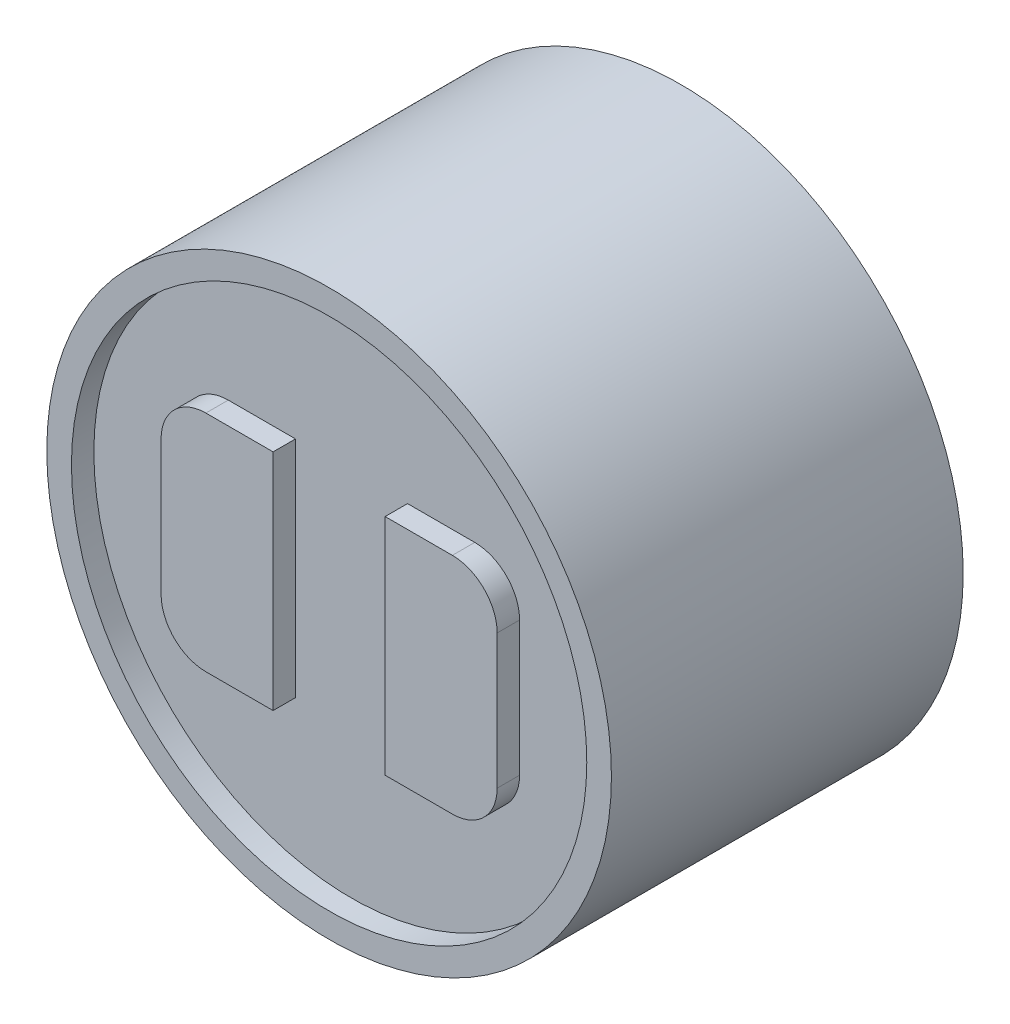
ISO-10303-21;
HEADER;
FILE_DESCRIPTION(('STEP AP214'),'2;1');
FILE_NAME('part.step','',(''),(''),'','','');
FILE_SCHEMA(('AUTOMOTIVE_DESIGN { 1 0 10303 214 1 1 1 1 }'));
ENDSEC;
DATA;
#1=APPLICATION_CONTEXT('core data for automotive mechanical design processes');
#2=APPLICATION_PROTOCOL_DEFINITION('international standard','automotive_design',2000,#1);
#3=PRODUCT_CONTEXT('',#1,'mechanical');
#4=PRODUCT('Part','Part','',(#3));
#5=PRODUCT_RELATED_PRODUCT_CATEGORY('part','',(#4));
#6=PRODUCT_DEFINITION_FORMATION('','',#4);
#7=PRODUCT_DEFINITION_CONTEXT('part definition',#1,'design');
#8=PRODUCT_DEFINITION('design','',#6,#7);
#9=PRODUCT_DEFINITION_SHAPE('','',#8);
#10=(LENGTH_UNIT() NAMED_UNIT(*) SI_UNIT(.MILLI.,.METRE.));
#11=(NAMED_UNIT(*) PLANE_ANGLE_UNIT() SI_UNIT($,.RADIAN.));
#12=(NAMED_UNIT(*) SI_UNIT($,.STERADIAN.) SOLID_ANGLE_UNIT());
#13=UNCERTAINTY_MEASURE_WITH_UNIT(LENGTH_MEASURE(1.E-05),#10,'distance_accuracy_value','');
#14=(GEOMETRIC_REPRESENTATION_CONTEXT(3) GLOBAL_UNCERTAINTY_ASSIGNED_CONTEXT((#13)) GLOBAL_UNIT_ASSIGNED_CONTEXT((#10,
#11,#12)) REPRESENTATION_CONTEXT('',''));
#15=CARTESIAN_POINT('',(0.,0.,0.));
#16=DIRECTION('',(0.,0.,1.));
#17=DIRECTION('',(1.,0.,0.));
#18=AXIS2_PLACEMENT_3D('',#15,#16,#17);
#19=CARTESIAN_POINT('',(-3.2333237010954,-8.71020362159421,28.1888965279297));
#20=DIRECTION('',(0.,0.,-1.));
#21=DIRECTION('',(-1.,0.,0.));
#22=AXIS2_PLACEMENT_3D('',#19,#20,#21);
#23=PLANE('',#22);
#24=CARTESIAN_POINT('',(-3.23332370109542,-7.18620362159421,28.1888965279297));
#25=DIRECTION('',(0.,0.,-1.));
#26=DIRECTION('',(-1.,0.,0.));
#27=AXIS2_PLACEMENT_3D('',#24,#25,#26);
#28=CIRCLE('',#27,0.508);
#29=CARTESIAN_POINT('',(-3.74132370109542,-7.18620362159421,28.1888965279297));
#30=VERTEX_POINT('',#29);
#31=CARTESIAN_POINT('',(-3.23332370109542,-6.67820362159421,28.1888965279297));
#32=VERTEX_POINT('',#31);
#33=EDGE_CURVE('E116',#30,#32,#28,.T.);
#34=ORIENTED_EDGE('',*,*,#33,.F.);
#35=DIRECTION('',(0.,1.,0.));
#36=VECTOR('',#35,1.);
#37=CARTESIAN_POINT('',(-3.74132370109541,-8.71020362159421,28.1888965279297));
#38=LINE('',#37,#36);
#39=CARTESIAN_POINT('',(-3.74132370109541,-8.71020362159421,28.1888965279297));
#40=VERTEX_POINT('',#39);
#41=EDGE_CURVE('E103',#40,#30,#38,.T.);
#42=ORIENTED_EDGE('',*,*,#41,.F.);
#43=CARTESIAN_POINT('',(-3.2333237010954,-8.71020362159421,28.1888965279297));
#44=DIRECTION('',(0.,0.,-1.));
#45=DIRECTION('',(-1.,0.,0.));
#46=AXIS2_PLACEMENT_3D('',#43,#44,#45);
#47=CIRCLE('',#46,0.508);
#48=CARTESIAN_POINT('',(-3.2333237010954,-9.21820362159421,28.1888965279297));
#49=VERTEX_POINT('',#48);
#50=EDGE_CURVE('E20',#49,#40,#47,.T.);
#51=ORIENTED_EDGE('',*,*,#50,.F.);
#52=DIRECTION('',(-1.,0.,0.));
#53=VECTOR('',#52,1.);
#54=CARTESIAN_POINT('',(-3.2333237010954,-9.21820362159421,28.1888965279297));
#55=LINE('',#54,#53);
#56=CARTESIAN_POINT('',(-2.4713237010954,-9.2182036215942,28.1888965279297));
#57=VERTEX_POINT('',#56);
#58=EDGE_CURVE('E89',#57,#49,#55,.T.);
#59=ORIENTED_EDGE('',*,*,#58,.F.);
#60=DIRECTION('',(0.,1.,0.));
#61=VECTOR('',#60,1.);
#62=CARTESIAN_POINT('',(-2.4713237010954,-9.2182036215942,28.1888965279297));
#63=LINE('',#62,#61);
#64=CARTESIAN_POINT('',(-2.47132370109542,-6.6782036215942,28.1888965279297));
#65=VERTEX_POINT('',#64);
#66=EDGE_CURVE('E198',#57,#65,#63,.T.);
#67=ORIENTED_EDGE('',*,*,#66,.T.);
#68=DIRECTION('',(-1.,0.,0.));
#69=VECTOR('',#68,1.);
#70=CARTESIAN_POINT('',(-3.23332370109542,-6.67820362159421,28.1888965279297));
#71=LINE('',#70,#69);
#72=EDGE_CURVE('E178',#65,#32,#71,.T.);
#73=ORIENTED_EDGE('',*,*,#72,.T.);
#74=EDGE_LOOP('',(#34,#42,#51,#59,#67,#73));
#75=FACE_BOUND('',#74,.T.);
#76=ADVANCED_FACE('F17',(#75),#23,.F.);
#77=CARTESIAN_POINT('',(-0.439323701095408,-8.71020362159419,28.1888965279297));
#78=DIRECTION('',(0.,0.,-1.));
#79=DIRECTION('',(-1.,0.,0.));
#80=AXIS2_PLACEMENT_3D('',#77,#78,#79);
#81=PLANE('',#80);
#82=CARTESIAN_POINT('',(-0.439323701095408,-8.71020362159419,28.1888965279297));
#83=DIRECTION('',(0.,0.,-1.));
#84=DIRECTION('',(-1.,0.,0.));
#85=AXIS2_PLACEMENT_3D('',#82,#83,#84);
#86=CIRCLE('',#85,0.508);
#87=CARTESIAN_POINT('',(0.0686762989045922,-8.71020362159418,28.1888965279297));
#88=VERTEX_POINT('',#87);
#89=CARTESIAN_POINT('',(-0.439323701095406,-9.21820362159419,28.1888965279297));
#90=VERTEX_POINT('',#89);
#91=EDGE_CURVE('E112',#88,#90,#86,.T.);
#92=ORIENTED_EDGE('',*,*,#91,.F.);
#93=DIRECTION('',(0.,1.,0.));
#94=VECTOR('',#93,1.);
#95=CARTESIAN_POINT('',(0.0686762989045922,-8.71020362159418,28.1888965279297));
#96=LINE('',#95,#94);
#97=CARTESIAN_POINT('',(0.0686762989045801,-7.18620362159418,28.1888965279297));
#98=VERTEX_POINT('',#97);
#99=EDGE_CURVE('E179',#98,#88,#96,.F.);
#100=ORIENTED_EDGE('',*,*,#99,.F.);
#101=CARTESIAN_POINT('',(-0.439323701095418,-7.18620362159419,28.1888965279297));
#102=DIRECTION('',(0.,0.,-1.));
#103=DIRECTION('',(-1.,0.,0.));
#104=AXIS2_PLACEMENT_3D('',#101,#102,#103);
#105=CIRCLE('',#104,0.508);
#106=CARTESIAN_POINT('',(-0.439323701095425,-6.67820362159419,28.1888965279297));
#107=VERTEX_POINT('',#106);
#108=EDGE_CURVE('E124',#107,#98,#105,.T.);
#109=ORIENTED_EDGE('',*,*,#108,.F.);
#110=DIRECTION('',(-1.,0.,0.));
#111=VECTOR('',#110,1.);
#112=CARTESIAN_POINT('',(-0.439323701095422,-6.67820362159419,28.1888965279297));
#113=LINE('',#112,#111);
#114=CARTESIAN_POINT('',(-1.20132370109542,-6.67820362159419,28.1888965279297));
#115=VERTEX_POINT('',#114);
#116=EDGE_CURVE('E119',#115,#107,#113,.F.);
#117=ORIENTED_EDGE('',*,*,#116,.F.);
#118=DIRECTION('',(0.,-1.,0.));
#119=VECTOR('',#118,1.);
#120=CARTESIAN_POINT('',(-1.2013237010954,-9.21820362159419,28.1888965279297));
#121=LINE('',#120,#119);
#122=CARTESIAN_POINT('',(-1.2013237010954,-9.21820362159419,28.1888965279297));
#123=VERTEX_POINT('',#122);
#124=EDGE_CURVE('E216',#115,#123,#121,.T.);
#125=ORIENTED_EDGE('',*,*,#124,.T.);
#126=DIRECTION('',(1.,0.,0.));
#127=VECTOR('',#126,1.);
#128=CARTESIAN_POINT('',(-1.2013237010954,-9.21820362159419,28.1888965279297));
#129=LINE('',#128,#127);
#130=EDGE_CURVE('E176',#123,#90,#129,.T.);
#131=ORIENTED_EDGE('',*,*,#130,.T.);
#132=EDGE_LOOP('',(#92,#100,#109,#117,#125,#131));
#133=FACE_BOUND('',#132,.T.);
#134=ADVANCED_FACE('F323',(#133),#81,.F.);
#135=CARTESIAN_POINT('',(-3.23332370109542,-7.18620362159421,28.1888965279297));
#136=DIRECTION('',(0.,0.,-1.));
#137=DIRECTION('',(-1.,0.,0.));
#138=AXIS2_PLACEMENT_3D('',#135,#136,#137);
#139=CYLINDRICAL_SURFACE('',#138,0.508);
#140=ORIENTED_EDGE('',*,*,#33,.T.);
#141=DIRECTION('',(0.,0.,-1.));
#142=VECTOR('',#141,1.);
#143=CARTESIAN_POINT('',(-3.23332370109542,-6.67820362159421,28.1888965279297));
#144=LINE('',#143,#142);
#145=CARTESIAN_POINT('',(-3.23332370109542,-6.67820362159421,27.9348965279297));
#146=VERTEX_POINT('',#145);
#147=EDGE_CURVE('E203',#32,#146,#144,.T.);
#148=ORIENTED_EDGE('',*,*,#147,.T.);
#149=CARTESIAN_POINT('',(-3.23332370109542,-7.18620362159421,27.9348965279297));
#150=DIRECTION('',(0.,0.,-1.));
#151=DIRECTION('',(-1.,0.,0.));
#152=AXIS2_PLACEMENT_3D('',#149,#150,#151);
#153=CIRCLE('',#152,0.508);
#154=CARTESIAN_POINT('',(-3.74132370109542,-7.18620362159421,27.9348965279297));
#155=VERTEX_POINT('',#154);
#156=EDGE_CURVE('E168',#155,#146,#153,.T.);
#157=ORIENTED_EDGE('',*,*,#156,.F.);
#158=DIRECTION('',(0.,0.,-1.));
#159=VECTOR('',#158,1.);
#160=CARTESIAN_POINT('',(-3.74132370109542,-7.18620362159421,28.1888965279297));
#161=LINE('',#160,#159);
#162=EDGE_CURVE('E113',#155,#30,#161,.F.);
#163=ORIENTED_EDGE('',*,*,#162,.T.);
#164=EDGE_LOOP('',(#140,#148,#157,#163));
#165=FACE_BOUND('',#164,.T.);
#166=ADVANCED_FACE('F494',(#165),#139,.T.);
#167=CARTESIAN_POINT('',(-3.23332370109542,-6.67820362159421,28.1888965279297));
#168=DIRECTION('',(0.,-1.,0.));
#169=DIRECTION('',(-1.,0.,0.));
#170=AXIS2_PLACEMENT_3D('',#167,#168,#169);
#171=PLANE('',#170);
#172=ORIENTED_EDGE('',*,*,#147,.F.);
#173=ORIENTED_EDGE('',*,*,#72,.F.);
#174=DIRECTION('',(0.,0.,-1.));
#175=VECTOR('',#174,1.);
#176=CARTESIAN_POINT('',(-2.47132370109542,-6.6782036215942,28.1888965279297));
#177=LINE('',#176,#175);
#178=CARTESIAN_POINT('',(-2.47132370109542,-6.6782036215942,27.9348965279297));
#179=VERTEX_POINT('',#178);
#180=EDGE_CURVE('E202',#65,#179,#177,.T.);
#181=ORIENTED_EDGE('',*,*,#180,.T.);
#182=DIRECTION('',(1.,0.,0.));
#183=VECTOR('',#182,1.);
#184=CARTESIAN_POINT('',(-1.83632370109542,-6.6782036215942,27.9348965279297));
#185=LINE('',#184,#183);
#186=EDGE_CURVE('E172',#146,#179,#185,.T.);
#187=ORIENTED_EDGE('',*,*,#186,.F.);
#188=EDGE_LOOP('',(#172,#173,#181,#187));
#189=FACE_BOUND('',#188,.T.);
#190=ADVANCED_FACE('F254',(#189),#171,.F.);
#191=CARTESIAN_POINT('',(-2.4713237010954,-9.2182036215942,28.1888965279297));
#192=DIRECTION('',(-1.,0.,0.));
#193=DIRECTION('',(0.,1.,0.));
#194=AXIS2_PLACEMENT_3D('',#191,#192,#193);
#195=PLANE('',#194);
#196=ORIENTED_EDGE('',*,*,#180,.F.);
#197=ORIENTED_EDGE('',*,*,#66,.F.);
#198=DIRECTION('',(0.,0.,-1.));
#199=VECTOR('',#198,1.);
#200=CARTESIAN_POINT('',(-2.4713237010954,-9.2182036215942,28.1888965279297));
#201=LINE('',#200,#199);
#202=CARTESIAN_POINT('',(-2.4713237010954,-9.2182036215942,27.9348965279297));
#203=VERTEX_POINT('',#202);
#204=EDGE_CURVE('E239',#57,#203,#201,.T.);
#205=ORIENTED_EDGE('',*,*,#204,.T.);
#206=DIRECTION('',(0.,1.,0.));
#207=VECTOR('',#206,1.);
#208=CARTESIAN_POINT('',(-2.47132370109541,-7.9482036215942,27.9348965279297));
#209=LINE('',#208,#207);
#210=EDGE_CURVE('E245',#179,#203,#209,.F.);
#211=ORIENTED_EDGE('',*,*,#210,.F.);
#212=EDGE_LOOP('',(#196,#197,#205,#211));
#213=FACE_BOUND('',#212,.T.);
#214=ADVANCED_FACE('F259',(#213),#195,.F.);
#215=CARTESIAN_POINT('',(-3.2333237010954,-9.21820362159421,28.1888965279297));
#216=DIRECTION('',(0.,1.,0.));
#217=DIRECTION('',(1.,0.,0.));
#218=AXIS2_PLACEMENT_3D('',#215,#216,#217);
#219=PLANE('',#218);
#220=ORIENTED_EDGE('',*,*,#204,.F.);
#221=ORIENTED_EDGE('',*,*,#58,.T.);
#222=DIRECTION('',(0.,0.,-1.));
#223=VECTOR('',#222,1.);
#224=CARTESIAN_POINT('',(-3.2333237010954,-9.21820362159421,28.1888965279297));
#225=LINE('',#224,#223);
#226=CARTESIAN_POINT('',(-3.2333237010954,-9.21820362159421,27.9348965279297));
#227=VERTEX_POINT('',#226);
#228=EDGE_CURVE('E99',#227,#49,#225,.F.);
#229=ORIENTED_EDGE('',*,*,#228,.F.);
#230=DIRECTION('',(1.,0.,0.));
#231=VECTOR('',#230,1.);
#232=CARTESIAN_POINT('',(-1.8363237010954,-9.2182036215942,27.9348965279297));
#233=LINE('',#232,#231);
#234=EDGE_CURVE('E167',#203,#227,#233,.F.);
#235=ORIENTED_EDGE('',*,*,#234,.F.);
#236=EDGE_LOOP('',(#220,#221,#229,#235));
#237=FACE_BOUND('',#236,.T.);
#238=ADVANCED_FACE('F317',(#237),#219,.F.);
#239=CARTESIAN_POINT('',(-3.2333237010954,-8.71020362159421,28.1888965279297));
#240=DIRECTION('',(0.,0.,-1.));
#241=DIRECTION('',(-1.,0.,0.));
#242=AXIS2_PLACEMENT_3D('',#239,#240,#241);
#243=CYLINDRICAL_SURFACE('',#242,0.508);
#244=ORIENTED_EDGE('',*,*,#50,.T.);
#245=DIRECTION('',(0.,0.,-1.));
#246=VECTOR('',#245,1.);
#247=CARTESIAN_POINT('',(-3.74132370109541,-8.71020362159421,28.1888965279297));
#248=LINE('',#247,#246);
#249=CARTESIAN_POINT('',(-3.74132370109541,-8.71020362159421,27.9348965279297));
#250=VERTEX_POINT('',#249);
#251=EDGE_CURVE('E97',#40,#250,#248,.T.);
#252=ORIENTED_EDGE('',*,*,#251,.T.);
#253=CARTESIAN_POINT('',(-3.2333237010954,-8.71020362159421,27.9348965279297));
#254=DIRECTION('',(0.,0.,-1.));
#255=DIRECTION('',(-1.,0.,0.));
#256=AXIS2_PLACEMENT_3D('',#253,#254,#255);
#257=CIRCLE('',#256,0.508);
#258=EDGE_CURVE('E164',#227,#250,#257,.T.);
#259=ORIENTED_EDGE('',*,*,#258,.F.);
#260=ORIENTED_EDGE('',*,*,#228,.T.);
#261=EDGE_LOOP('',(#244,#252,#259,#260));
#262=FACE_BOUND('',#261,.T.);
#263=ADVANCED_FACE('F95',(#262),#243,.T.);
#264=CARTESIAN_POINT('',(-3.74132370109541,-8.71020362159421,28.1888965279297));
#265=DIRECTION('',(1.,0.,0.));
#266=DIRECTION('',(0.,-1.,0.));
#267=AXIS2_PLACEMENT_3D('',#264,#265,#266);
#268=PLANE('',#267);
#269=ORIENTED_EDGE('',*,*,#251,.F.);
#270=ORIENTED_EDGE('',*,*,#41,.T.);
#271=ORIENTED_EDGE('',*,*,#162,.F.);
#272=DIRECTION('',(0.,1.,0.));
#273=VECTOR('',#272,1.);
#274=CARTESIAN_POINT('',(-3.74132370109542,-7.94820362159421,27.9348965279297));
#275=LINE('',#274,#273);
#276=EDGE_CURVE('E109',#250,#155,#275,.T.);
#277=ORIENTED_EDGE('',*,*,#276,.F.);
#278=EDGE_LOOP('',(#269,#270,#271,#277));
#279=FACE_BOUND('',#278,.T.);
#280=ADVANCED_FACE('F105',(#279),#268,.F.);
#281=CARTESIAN_POINT('',(-0.439323701095408,-8.71020362159419,28.1888965279297));
#282=DIRECTION('',(0.,0.,-1.));
#283=DIRECTION('',(-1.,0.,0.));
#284=AXIS2_PLACEMENT_3D('',#281,#282,#283);
#285=CYLINDRICAL_SURFACE('',#284,0.508);
#286=ORIENTED_EDGE('',*,*,#91,.T.);
#287=DIRECTION('',(0.,0.,-1.));
#288=VECTOR('',#287,1.);
#289=CARTESIAN_POINT('',(-0.439323701095408,-9.21820362159419,28.1888965279297));
#290=LINE('',#289,#288);
#291=CARTESIAN_POINT('',(-0.439323701095406,-9.21820362159419,27.9348965279297));
#292=VERTEX_POINT('',#291);
#293=EDGE_CURVE('E220',#90,#292,#290,.T.);
#294=ORIENTED_EDGE('',*,*,#293,.T.);
#295=CARTESIAN_POINT('',(-0.439323701095408,-8.71020362159419,27.9348965279297));
#296=DIRECTION('',(0.,0.,-1.));
#297=DIRECTION('',(-1.,0.,0.));
#298=AXIS2_PLACEMENT_3D('',#295,#296,#297);
#299=CIRCLE('',#298,0.508);
#300=CARTESIAN_POINT('',(0.0686762989045922,-8.71020362159418,27.9348965279297));
#301=VERTEX_POINT('',#300);
#302=EDGE_CURVE('E159',#301,#292,#299,.T.);
#303=ORIENTED_EDGE('',*,*,#302,.F.);
#304=DIRECTION('',(0.,0.,-1.));
#305=VECTOR('',#304,1.);
#306=CARTESIAN_POINT('',(0.0686762989045922,-8.71020362159418,28.1888965279297));
#307=LINE('',#306,#305);
#308=EDGE_CURVE('E274',#301,#88,#307,.F.);
#309=ORIENTED_EDGE('',*,*,#308,.T.);
#310=EDGE_LOOP('',(#286,#294,#303,#309));
#311=FACE_BOUND('',#310,.T.);
#312=ADVANCED_FACE('F330',(#311),#285,.T.);
#313=CARTESIAN_POINT('',(-1.2013237010954,-9.21820362159419,28.1888965279297));
#314=DIRECTION('',(0.,1.,0.));
#315=DIRECTION('',(1.,0.,0.));
#316=AXIS2_PLACEMENT_3D('',#313,#314,#315);
#317=PLANE('',#316);
#318=ORIENTED_EDGE('',*,*,#293,.F.);
#319=ORIENTED_EDGE('',*,*,#130,.F.);
#320=DIRECTION('',(0.,0.,-1.));
#321=VECTOR('',#320,1.);
#322=CARTESIAN_POINT('',(-1.2013237010954,-9.21820362159419,28.1888965279297));
#323=LINE('',#322,#321);
#324=CARTESIAN_POINT('',(-1.2013237010954,-9.21820362159419,27.9348965279297));
#325=VERTEX_POINT('',#324);
#326=EDGE_CURVE('E219',#123,#325,#323,.T.);
#327=ORIENTED_EDGE('',*,*,#326,.T.);
#328=DIRECTION('',(1.,0.,0.));
#329=VECTOR('',#328,1.);
#330=CARTESIAN_POINT('',(-1.8363237010954,-9.2182036215942,27.9348965279297));
#331=LINE('',#330,#329);
#332=EDGE_CURVE('E163',#292,#325,#331,.F.);
#333=ORIENTED_EDGE('',*,*,#332,.F.);
#334=EDGE_LOOP('',(#318,#319,#327,#333));
#335=FACE_BOUND('',#334,.T.);
#336=ADVANCED_FACE('F296',(#335),#317,.F.);
#337=CARTESIAN_POINT('',(-1.2013237010954,-9.21820362159419,28.1888965279297));
#338=DIRECTION('',(1.,0.,0.));
#339=DIRECTION('',(0.,-1.,0.));
#340=AXIS2_PLACEMENT_3D('',#337,#338,#339);
#341=PLANE('',#340);
#342=ORIENTED_EDGE('',*,*,#326,.F.);
#343=ORIENTED_EDGE('',*,*,#124,.F.);
#344=DIRECTION('',(0.,0.,-1.));
#345=VECTOR('',#344,1.);
#346=CARTESIAN_POINT('',(-1.20132370109542,-6.67820362159419,28.1888965279297));
#347=LINE('',#346,#345);
#348=CARTESIAN_POINT('',(-1.20132370109542,-6.67820362159419,27.9348965279297));
#349=VERTEX_POINT('',#348);
#350=EDGE_CURVE('E281',#115,#349,#347,.T.);
#351=ORIENTED_EDGE('',*,*,#350,.T.);
#352=DIRECTION('',(0.,1.,0.));
#353=VECTOR('',#352,1.);
#354=CARTESIAN_POINT('',(-1.20132370109541,-7.94820362159419,27.9348965279297));
#355=LINE('',#354,#353);
#356=EDGE_CURVE('E287',#325,#349,#355,.T.);
#357=ORIENTED_EDGE('',*,*,#356,.F.);
#358=EDGE_LOOP('',(#342,#343,#351,#357));
#359=FACE_BOUND('',#358,.T.);
#360=ADVANCED_FACE('F301',(#359),#341,.F.);
#361=CARTESIAN_POINT('',(-1.20132370109542,-6.67820362159419,28.1888965279297));
#362=DIRECTION('',(0.,-1.,0.));
#363=DIRECTION('',(-1.,0.,0.));
#364=AXIS2_PLACEMENT_3D('',#361,#362,#363);
#365=PLANE('',#364);
#366=ORIENTED_EDGE('',*,*,#350,.F.);
#367=ORIENTED_EDGE('',*,*,#116,.T.);
#368=DIRECTION('',(0.,0.,-1.));
#369=VECTOR('',#368,1.);
#370=CARTESIAN_POINT('',(-0.439323701095427,-6.67820362159419,28.1888965279297));
#371=LINE('',#370,#369);
#372=CARTESIAN_POINT('',(-0.439323701095425,-6.67820362159419,27.9348965279297));
#373=VERTEX_POINT('',#372);
#374=EDGE_CURVE('E278',#373,#107,#371,.F.);
#375=ORIENTED_EDGE('',*,*,#374,.F.);
#376=DIRECTION('',(1.,0.,0.));
#377=VECTOR('',#376,1.);
#378=CARTESIAN_POINT('',(-1.83632370109542,-6.6782036215942,27.9348965279297));
#379=LINE('',#378,#377);
#380=EDGE_CURVE('E158',#349,#373,#379,.T.);
#381=ORIENTED_EDGE('',*,*,#380,.F.);
#382=EDGE_LOOP('',(#366,#367,#375,#381));
#383=FACE_BOUND('',#382,.T.);
#384=ADVANCED_FACE('F325',(#383),#365,.F.);
#385=CARTESIAN_POINT('',(-0.439323701095418,-7.18620362159419,28.1888965279297));
#386=DIRECTION('',(0.,0.,-1.));
#387=DIRECTION('',(-1.,0.,0.));
#388=AXIS2_PLACEMENT_3D('',#385,#386,#387);
#389=CYLINDRICAL_SURFACE('',#388,0.508);
#390=ORIENTED_EDGE('',*,*,#108,.T.);
#391=DIRECTION('',(0.,0.,-1.));
#392=VECTOR('',#391,1.);
#393=CARTESIAN_POINT('',(0.0686762989045801,-7.18620362159418,28.1888965279297));
#394=LINE('',#393,#392);
#395=CARTESIAN_POINT('',(0.0686762989045801,-7.18620362159418,27.9348965279297));
#396=VERTEX_POINT('',#395);
#397=EDGE_CURVE('E36',#98,#396,#394,.T.);
#398=ORIENTED_EDGE('',*,*,#397,.T.);
#399=CARTESIAN_POINT('',(-0.439323701095418,-7.18620362159419,27.9348965279297));
#400=DIRECTION('',(0.,0.,-1.));
#401=DIRECTION('',(-1.,0.,0.));
#402=AXIS2_PLACEMENT_3D('',#399,#400,#401);
#403=CIRCLE('',#402,0.508);
#404=EDGE_CURVE('E154',#373,#396,#403,.T.);
#405=ORIENTED_EDGE('',*,*,#404,.F.);
#406=ORIENTED_EDGE('',*,*,#374,.T.);
#407=EDGE_LOOP('',(#390,#398,#405,#406));
#408=FACE_BOUND('',#407,.T.);
#409=ADVANCED_FACE('F370',(#408),#389,.T.);
#410=CARTESIAN_POINT('',(0.0686762989045922,-8.71020362159418,28.1888965279297));
#411=DIRECTION('',(-1.,0.,0.));
#412=DIRECTION('',(0.,1.,0.));
#413=AXIS2_PLACEMENT_3D('',#410,#411,#412);
#414=PLANE('',#413);
#415=ORIENTED_EDGE('',*,*,#397,.F.);
#416=ORIENTED_EDGE('',*,*,#99,.T.);
#417=ORIENTED_EDGE('',*,*,#308,.F.);
#418=DIRECTION('',(0.,1.,0.));
#419=VECTOR('',#418,1.);
#420=CARTESIAN_POINT('',(0.068676298904587,-7.94820362159418,27.9348965279297));
#421=LINE('',#420,#419);
#422=EDGE_CURVE('E153',#396,#301,#421,.F.);
#423=ORIENTED_EDGE('',*,*,#422,.F.);
#424=EDGE_LOOP('',(#415,#416,#417,#423));
#425=FACE_BOUND('',#424,.T.);
#426=ADVANCED_FACE('F329',(#425),#414,.F.);
#427=CARTESIAN_POINT('',(-1.83632370109541,-7.9482036215942,24.8360965279297));
#428=DIRECTION('',(0.,0.,-1.));
#429=DIRECTION('',(-1.,0.,0.));
#430=AXIS2_PLACEMENT_3D('',#427,#428,#429);
#431=PLANE('',#430);
#432=CARTESIAN_POINT('',(-1.83632370109541,-7.9482036215942,24.8360965279297));
#433=DIRECTION('',(0.,0.,-1.));
#434=DIRECTION('',(-1.,0.,0.));
#435=AXIS2_PLACEMENT_3D('',#432,#433,#434);
#436=CIRCLE('',#435,0.635);
#437=CARTESIAN_POINT('',(-2.47132370109541,-7.94820362159421,24.8360965279297));
#438=VERTEX_POINT('',#437);
#439=EDGE_CURVE('E149',#438,#438,#436,.T.);
#440=ORIENTED_EDGE('',*,*,#439,.T.);
#441=EDGE_LOOP('',(#440));
#442=FACE_BOUND('',#441,.T.);
#443=ADVANCED_FACE('F364',(#442),#431,.T.);
#444=CARTESIAN_POINT('',(-1.83632370109541,-7.9482036215942,27.9348965279297));
#445=DIRECTION('',(0.,0.,1.));
#446=DIRECTION('',(1.,0.,0.));
#447=AXIS2_PLACEMENT_3D('',#444,#445,#446);
#448=PLANE('',#447);
#449=ORIENTED_EDGE('',*,*,#404,.T.);
#450=ORIENTED_EDGE('',*,*,#422,.T.);
#451=ORIENTED_EDGE('',*,*,#302,.T.);
#452=ORIENTED_EDGE('',*,*,#332,.T.);
#453=ORIENTED_EDGE('',*,*,#356,.T.);
#454=ORIENTED_EDGE('',*,*,#380,.T.);
#455=EDGE_LOOP('',(#449,#450,#451,#452,#453,#454));
#456=FACE_BOUND('',#455,.T.);
#457=CARTESIAN_POINT('',(-1.83632370109541,-7.9482036215942,27.9348965279297));
#458=DIRECTION('',(0.,0.,1.));
#459=DIRECTION('',(1.,0.,0.));
#460=AXIS2_PLACEMENT_3D('',#457,#458,#459);
#461=CIRCLE('',#460,2.921);
#462=CARTESIAN_POINT('',(1.08467629890459,-7.94820362159418,27.9348965279297));
#463=VERTEX_POINT('',#462);
#464=EDGE_CURVE('E145',#463,#463,#461,.T.);
#465=ORIENTED_EDGE('',*,*,#464,.T.);
#466=EDGE_LOOP('',(#465));
#467=FACE_BOUND('',#466,.T.);
#468=ORIENTED_EDGE('',*,*,#258,.T.);
#469=ORIENTED_EDGE('',*,*,#276,.T.);
#470=ORIENTED_EDGE('',*,*,#156,.T.);
#471=ORIENTED_EDGE('',*,*,#186,.T.);
#472=ORIENTED_EDGE('',*,*,#210,.T.);
#473=ORIENTED_EDGE('',*,*,#234,.T.);
#474=EDGE_LOOP('',(#468,#469,#470,#471,#472,#473));
#475=FACE_BOUND('',#474,.T.);
#476=ADVANCED_FACE('F263',(#456,#467,#475),#448,.T.);
#477=CARTESIAN_POINT('',(-1.83632370109541,-7.9482036215942,24.8360965279297));
#478=DIRECTION('',(0.,0.,-1.));
#479=DIRECTION('',(-1.,0.,0.));
#480=AXIS2_PLACEMENT_3D('',#477,#478,#479);
#481=CYLINDRICAL_SURFACE('',#480,0.635);
#482=CARTESIAN_POINT('',(-1.83632370109541,-7.9482036215942,24.2010965279297));
#483=DIRECTION('',(0.,0.,-1.));
#484=DIRECTION('',(-1.,0.,0.));
#485=AXIS2_PLACEMENT_3D('',#482,#483,#484);
#486=CIRCLE('',#485,0.635);
#487=CARTESIAN_POINT('',(-2.47132370109541,-7.94820362159421,24.2010965279297));
#488=VERTEX_POINT('',#487);
#489=EDGE_CURVE('E141',#488,#488,#486,.F.);
#490=ORIENTED_EDGE('',*,*,#489,.F.);
#491=EDGE_LOOP('',(#490));
#492=FACE_BOUND('',#491,.T.);
#493=ORIENTED_EDGE('',*,*,#439,.F.);
#494=EDGE_LOOP('',(#493));
#495=FACE_BOUND('',#494,.T.);
#496=ADVANCED_FACE('F357',(#492,#495),#481,.F.);
#497=CARTESIAN_POINT('',(-1.83632370109541,-7.9482036215942,27.9348965279297));
#498=DIRECTION('',(0.,0.,1.));
#499=DIRECTION('',(1.,0.,0.));
#500=AXIS2_PLACEMENT_3D('',#497,#498,#499);
#501=CYLINDRICAL_SURFACE('',#500,2.921);
#502=ORIENTED_EDGE('',*,*,#464,.F.);
#503=EDGE_LOOP('',(#502));
#504=FACE_BOUND('',#503,.T.);
#505=CARTESIAN_POINT('',(-1.83632370109541,-7.9482036215942,28.1888965279297));
#506=DIRECTION('',(0.,0.,1.));
#507=DIRECTION('',(1.,0.,0.));
#508=AXIS2_PLACEMENT_3D('',#505,#506,#507);
#509=CIRCLE('',#508,2.921);
#510=CARTESIAN_POINT('',(1.08467629890459,-7.94820362159418,28.1888965279297));
#511=VERTEX_POINT('',#510);
#512=EDGE_CURVE('E137',#511,#511,#509,.T.);
#513=ORIENTED_EDGE('',*,*,#512,.T.);
#514=EDGE_LOOP('',(#513));
#515=FACE_BOUND('',#514,.T.);
#516=ADVANCED_FACE('F353',(#504,#515),#501,.F.);
#517=CARTESIAN_POINT('',(-1.83632370109541,-7.9482036215942,24.2010965279297));
#518=DIRECTION('',(0.,0.,-1.));
#519=DIRECTION('',(-1.,0.,0.));
#520=AXIS2_PLACEMENT_3D('',#517,#518,#519);
#521=PLANE('',#520);
#522=CARTESIAN_POINT('',(-1.83632370109541,-7.9482036215942,24.2010965279297));
#523=DIRECTION('',(0.,0.,1.));
#524=DIRECTION('',(1.,0.,0.));
#525=AXIS2_PLACEMENT_3D('',#522,#523,#524);
#526=CIRCLE('',#525,3.2004);
#527=CARTESIAN_POINT('',(1.36407629890458,-7.94820362159418,24.2010965279297));
#528=VERTEX_POINT('',#527);
#529=EDGE_CURVE('E27',#528,#528,#526,.T.);
#530=ORIENTED_EDGE('',*,*,#529,.F.);
#531=EDGE_LOOP('',(#530));
#532=FACE_BOUND('',#531,.T.);
#533=ORIENTED_EDGE('',*,*,#489,.T.);
#534=EDGE_LOOP('',(#533));
#535=FACE_BOUND('',#534,.T.);
#536=ADVANCED_FACE('F346',(#532,#535),#521,.T.);
#537=CARTESIAN_POINT('',(-1.83632370109541,-7.9482036215942,28.1888965279297));
#538=DIRECTION('',(0.,0.,-1.));
#539=DIRECTION('',(-1.,0.,0.));
#540=AXIS2_PLACEMENT_3D('',#537,#538,#539);
#541=PLANE('',#540);
#542=CARTESIAN_POINT('',(-1.83632370109541,-7.9482036215942,28.1888965279297));
#543=DIRECTION('',(0.,0.,1.));
#544=DIRECTION('',(1.,0.,0.));
#545=AXIS2_PLACEMENT_3D('',#542,#543,#544);
#546=CIRCLE('',#545,3.2004);
#547=CARTESIAN_POINT('',(1.36407629890458,-7.94820362159418,28.1888965279297));
#548=VERTEX_POINT('',#547);
#549=EDGE_CURVE('E11',#548,#548,#546,.F.);
#550=ORIENTED_EDGE('',*,*,#549,.F.);
#551=EDGE_LOOP('',(#550));
#552=FACE_BOUND('',#551,.T.);
#553=ORIENTED_EDGE('',*,*,#512,.F.);
#554=EDGE_LOOP('',(#553));
#555=FACE_BOUND('',#554,.T.);
#556=ADVANCED_FACE('F341',(#552,#555),#541,.F.);
#557=CARTESIAN_POINT('',(-1.83632370109541,-7.9482036215942,24.2010965279297));
#558=DIRECTION('',(0.,0.,1.));
#559=DIRECTION('',(1.,0.,0.));
#560=AXIS2_PLACEMENT_3D('',#557,#558,#559);
#561=CYLINDRICAL_SURFACE('',#560,3.2004);
#562=ORIENTED_EDGE('',*,*,#549,.T.);
#563=EDGE_LOOP('',(#562));
#564=FACE_BOUND('',#563,.T.);
#565=ORIENTED_EDGE('',*,*,#529,.T.);
#566=EDGE_LOOP('',(#565));
#567=FACE_BOUND('',#566,.T.);
#568=ADVANCED_FACE('F339',(#564,#567),#561,.T.);
#569=CLOSED_SHELL('',(#76,#134,#166,#190,#214,#238,#263,#280,#312,#336,#360,#384,#409,#426,#443,
#476,#496,#516,#536,#556,#568));
#570=MANIFOLD_SOLID_BREP('B1',#569);
#571=ADVANCED_BREP_SHAPE_REPRESENTATION('',(#18,#570),#14);
#572=SHAPE_DEFINITION_REPRESENTATION(#9,#571);
ENDSEC;
END-ISO-10303-21;
